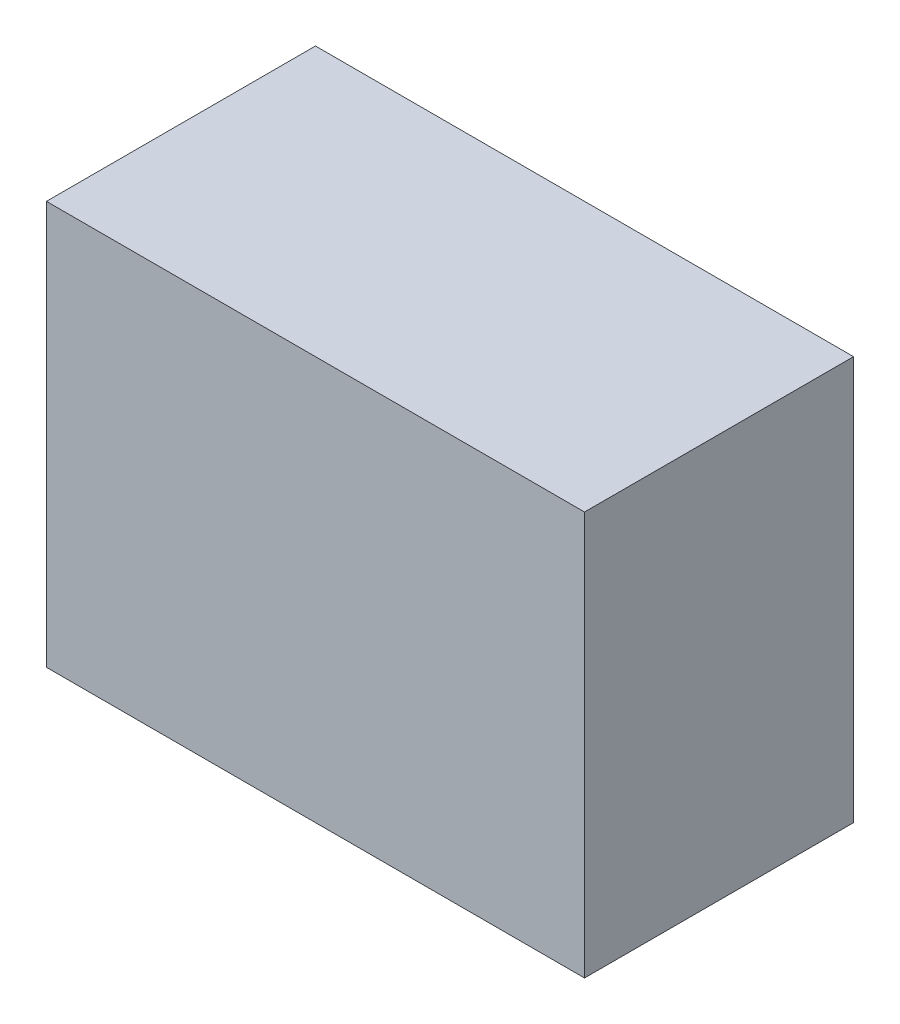
ISO-10303-21;
HEADER;
FILE_DESCRIPTION(('STEP AP214'),'2;1');
FILE_NAME('part.step','',(''),(''),'','','');
FILE_SCHEMA(('AUTOMOTIVE_DESIGN { 1 0 10303 214 1 1 1 1 }'));
ENDSEC;
DATA;
#1=APPLICATION_CONTEXT('core data for automotive mechanical design processes');
#2=APPLICATION_PROTOCOL_DEFINITION('international standard','automotive_design',2000,#1);
#3=PRODUCT_CONTEXT('',#1,'mechanical');
#4=PRODUCT('Part','Part','',(#3));
#5=PRODUCT_RELATED_PRODUCT_CATEGORY('part','',(#4));
#6=PRODUCT_DEFINITION_FORMATION('','',#4);
#7=PRODUCT_DEFINITION_CONTEXT('part definition',#1,'design');
#8=PRODUCT_DEFINITION('design','',#6,#7);
#9=PRODUCT_DEFINITION_SHAPE('','',#8);
#10=(LENGTH_UNIT() NAMED_UNIT(*) SI_UNIT(.MILLI.,.METRE.));
#11=(NAMED_UNIT(*) PLANE_ANGLE_UNIT() SI_UNIT($,.RADIAN.));
#12=(NAMED_UNIT(*) SI_UNIT($,.STERADIAN.) SOLID_ANGLE_UNIT());
#13=UNCERTAINTY_MEASURE_WITH_UNIT(LENGTH_MEASURE(1.E-05),#10,'distance_accuracy_value','');
#14=(GEOMETRIC_REPRESENTATION_CONTEXT(3) GLOBAL_UNCERTAINTY_ASSIGNED_CONTEXT((#13)) GLOBAL_UNIT_ASSIGNED_CONTEXT((#10,
#11,#12)) REPRESENTATION_CONTEXT('',''));
#15=CARTESIAN_POINT('',(0.,0.,0.));
#16=DIRECTION('',(0.,0.,1.));
#17=DIRECTION('',(1.,0.,0.));
#18=AXIS2_PLACEMENT_3D('',#15,#16,#17);
#19=CARTESIAN_POINT('',(0.,0.,20.));
#20=DIRECTION('',(1.,0.,0.));
#21=DIRECTION('',(0.,1.,0.));
#22=AXIS2_PLACEMENT_3D('',#19,#20,#21);
#23=PLANE('',#22);
#24=DIRECTION('',(0.,-1.,0.));
#25=VECTOR('',#24,1.);
#26=CARTESIAN_POINT('',(0.,0.,0.));
#27=LINE('',#26,#25);
#28=CARTESIAN_POINT('',(0.,30.,0.));
#29=VERTEX_POINT('',#28);
#30=CARTESIAN_POINT('',(0.,0.,0.));
#31=VERTEX_POINT('',#30);
#32=EDGE_CURVE('E96',#29,#31,#27,.T.);
#33=ORIENTED_EDGE('',*,*,#32,.T.);
#34=DIRECTION('',(0.,0.,-1.));
#35=VECTOR('',#34,1.);
#36=CARTESIAN_POINT('',(0.,0.,20.));
#37=LINE('',#36,#35);
#38=CARTESIAN_POINT('',(0.,0.,20.));
#39=VERTEX_POINT('',#38);
#40=EDGE_CURVE('E11',#39,#31,#37,.T.);
#41=ORIENTED_EDGE('',*,*,#40,.F.);
#42=DIRECTION('',(0.,-1.,0.));
#43=VECTOR('',#42,1.);
#44=CARTESIAN_POINT('',(0.,0.,20.));
#45=LINE('',#44,#43);
#46=CARTESIAN_POINT('',(0.,30.,20.));
#47=VERTEX_POINT('',#46);
#48=EDGE_CURVE('E84',#47,#39,#45,.T.);
#49=ORIENTED_EDGE('',*,*,#48,.F.);
#50=DIRECTION('',(0.,0.,-1.));
#51=VECTOR('',#50,1.);
#52=CARTESIAN_POINT('',(0.,30.,20.));
#53=LINE('',#52,#51);
#54=EDGE_CURVE('E92',#47,#29,#53,.T.);
#55=ORIENTED_EDGE('',*,*,#54,.T.);
#56=EDGE_LOOP('',(#33,#41,#49,#55));
#57=FACE_BOUND('',#56,.T.);
#58=ADVANCED_FACE('F33',(#57),#23,.F.);
#59=CARTESIAN_POINT('',(0.,0.,20.));
#60=DIRECTION('',(0.,1.,0.));
#61=DIRECTION('',(0.,0.,1.));
#62=AXIS2_PLACEMENT_3D('',#59,#60,#61);
#63=PLANE('',#62);
#64=DIRECTION('',(1.,0.,0.));
#65=VECTOR('',#64,1.);
#66=CARTESIAN_POINT('',(0.,0.,0.));
#67=LINE('',#66,#65);
#68=CARTESIAN_POINT('',(40.,0.,0.));
#69=VERTEX_POINT('',#68);
#70=EDGE_CURVE('E88',#31,#69,#67,.T.);
#71=ORIENTED_EDGE('',*,*,#70,.T.);
#72=DIRECTION('',(0.,0.,-1.));
#73=VECTOR('',#72,1.);
#74=CARTESIAN_POINT('',(40.,0.,20.));
#75=LINE('',#74,#73);
#76=CARTESIAN_POINT('',(40.,0.,20.));
#77=VERTEX_POINT('',#76);
#78=EDGE_CURVE('E41',#77,#69,#75,.T.);
#79=ORIENTED_EDGE('',*,*,#78,.F.);
#80=DIRECTION('',(1.,0.,0.));
#81=VECTOR('',#80,1.);
#82=CARTESIAN_POINT('',(0.,0.,20.));
#83=LINE('',#82,#81);
#84=EDGE_CURVE('E79',#39,#77,#83,.T.);
#85=ORIENTED_EDGE('',*,*,#84,.F.);
#86=ORIENTED_EDGE('',*,*,#40,.T.);
#87=EDGE_LOOP('',(#71,#79,#85,#86));
#88=FACE_BOUND('',#87,.T.);
#89=ADVANCED_FACE('F87',(#88),#63,.F.);
#90=CARTESIAN_POINT('',(40.,0.,20.));
#91=DIRECTION('',(-1.,0.,0.));
#92=DIRECTION('',(0.,-1.,0.));
#93=AXIS2_PLACEMENT_3D('',#90,#91,#92);
#94=PLANE('',#93);
#95=DIRECTION('',(0.,1.,0.));
#96=VECTOR('',#95,1.);
#97=CARTESIAN_POINT('',(40.,0.,0.));
#98=LINE('',#97,#96);
#99=CARTESIAN_POINT('',(40.,30.,0.));
#100=VERTEX_POINT('',#99);
#101=EDGE_CURVE('E66',#69,#100,#98,.T.);
#102=ORIENTED_EDGE('',*,*,#101,.T.);
#103=DIRECTION('',(0.,0.,-1.));
#104=VECTOR('',#103,1.);
#105=CARTESIAN_POINT('',(40.,30.,20.));
#106=LINE('',#105,#104);
#107=CARTESIAN_POINT('',(40.,30.,20.));
#108=VERTEX_POINT('',#107);
#109=EDGE_CURVE('E89',#108,#100,#106,.T.);
#110=ORIENTED_EDGE('',*,*,#109,.F.);
#111=DIRECTION('',(0.,1.,0.));
#112=VECTOR('',#111,1.);
#113=CARTESIAN_POINT('',(40.,0.,20.));
#114=LINE('',#113,#112);
#115=EDGE_CURVE('E82',#77,#108,#114,.T.);
#116=ORIENTED_EDGE('',*,*,#115,.F.);
#117=ORIENTED_EDGE('',*,*,#78,.T.);
#118=EDGE_LOOP('',(#102,#110,#116,#117));
#119=FACE_BOUND('',#118,.T.);
#120=ADVANCED_FACE('F90',(#119),#94,.F.);
#121=CARTESIAN_POINT('',(0.,30.,20.));
#122=DIRECTION('',(0.,-1.,0.));
#123=DIRECTION('',(0.,0.,-1.));
#124=AXIS2_PLACEMENT_3D('',#121,#122,#123);
#125=PLANE('',#124);
#126=DIRECTION('',(-1.,0.,0.));
#127=VECTOR('',#126,1.);
#128=CARTESIAN_POINT('',(0.,30.,0.));
#129=LINE('',#128,#127);
#130=EDGE_CURVE('E72',#100,#29,#129,.T.);
#131=ORIENTED_EDGE('',*,*,#130,.T.);
#132=ORIENTED_EDGE('',*,*,#54,.F.);
#133=DIRECTION('',(-1.,0.,0.));
#134=VECTOR('',#133,1.);
#135=CARTESIAN_POINT('',(0.,30.,20.));
#136=LINE('',#135,#134);
#137=EDGE_CURVE('E49',#108,#47,#136,.T.);
#138=ORIENTED_EDGE('',*,*,#137,.F.);
#139=ORIENTED_EDGE('',*,*,#109,.T.);
#140=EDGE_LOOP('',(#131,#132,#138,#139));
#141=FACE_BOUND('',#140,.T.);
#142=ADVANCED_FACE('F104',(#141),#125,.F.);
#143=CARTESIAN_POINT('',(0.,0.,20.));
#144=DIRECTION('',(0.,0.,-1.));
#145=DIRECTION('',(-1.,0.,0.));
#146=AXIS2_PLACEMENT_3D('',#143,#144,#145);
#147=PLANE('',#146);
#148=ORIENTED_EDGE('',*,*,#48,.T.);
#149=ORIENTED_EDGE('',*,*,#84,.T.);
#150=ORIENTED_EDGE('',*,*,#115,.T.);
#151=ORIENTED_EDGE('',*,*,#137,.T.);
#152=EDGE_LOOP('',(#148,#149,#150,#151));
#153=FACE_BOUND('',#152,.T.);
#154=ADVANCED_FACE('F80',(#153),#147,.F.);
#155=CARTESIAN_POINT('',(0.,0.,0.));
#156=DIRECTION('',(0.,0.,-1.));
#157=DIRECTION('',(-1.,0.,0.));
#158=AXIS2_PLACEMENT_3D('',#155,#156,#157);
#159=PLANE('',#158);
#160=CARTESIAN_POINT('',(20.,15.,0.));
#161=DIRECTION('',(0.,0.,-1.));
#162=DIRECTION('',(-1.,0.,0.));
#163=AXIS2_PLACEMENT_3D('',#160,#161,#162);
#164=CIRCLE('',#163,11.);
#165=CARTESIAN_POINT('',(9.00000000000001,15.,0.));
#166=VERTEX_POINT('',#165);
#167=EDGE_CURVE('E110',#166,#166,#164,.T.);
#168=ORIENTED_EDGE('',*,*,#167,.F.);
#169=EDGE_LOOP('',(#168));
#170=FACE_BOUND('',#169,.T.);
#171=ORIENTED_EDGE('',*,*,#32,.F.);
#172=ORIENTED_EDGE('',*,*,#130,.F.);
#173=ORIENTED_EDGE('',*,*,#101,.F.);
#174=ORIENTED_EDGE('',*,*,#70,.F.);
#175=EDGE_LOOP('',(#171,#172,#173,#174));
#176=FACE_BOUND('',#175,.T.);
#177=ADVANCED_FACE('F107',(#170,#176),#159,.T.);
#178=CARTESIAN_POINT('',(20.,15.,7.));
#179=DIRECTION('',(0.,0.,-1.));
#180=DIRECTION('',(-1.,0.,0.));
#181=AXIS2_PLACEMENT_3D('',#178,#179,#180);
#182=CYLINDRICAL_SURFACE('',#181,11.);
#183=CARTESIAN_POINT('',(20.,15.,7.));
#184=DIRECTION('',(0.,0.,-1.));
#185=DIRECTION('',(-1.,0.,0.));
#186=AXIS2_PLACEMENT_3D('',#183,#184,#185);
#187=CIRCLE('',#186,11.);
#188=CARTESIAN_POINT('',(9.00000000000001,15.,7.));
#189=VERTEX_POINT('',#188);
#190=EDGE_CURVE('E99',#189,#189,#187,.T.);
#191=ORIENTED_EDGE('',*,*,#190,.F.);
#192=EDGE_LOOP('',(#191));
#193=FACE_BOUND('',#192,.T.);
#194=ORIENTED_EDGE('',*,*,#167,.T.);
#195=EDGE_LOOP('',(#194));
#196=FACE_BOUND('',#195,.T.);
#197=ADVANCED_FACE('F118',(#193,#196),#182,.F.);
#198=CARTESIAN_POINT('',(20.,15.,7.));
#199=DIRECTION('',(0.,0.,-1.));
#200=DIRECTION('',(-1.,0.,0.));
#201=AXIS2_PLACEMENT_3D('',#198,#199,#200);
#202=PLANE('',#201);
#203=ORIENTED_EDGE('',*,*,#190,.T.);
#204=EDGE_LOOP('',(#203));
#205=FACE_BOUND('',#204,.T.);
#206=ADVANCED_FACE('F116',(#205),#202,.T.);
#207=CLOSED_SHELL('',(#58,#89,#120,#142,#154,#177,#197,#206));
#208=MANIFOLD_SOLID_BREP('B2',#207);
#209=ADVANCED_BREP_SHAPE_REPRESENTATION('',(#18,#208),#14);
#210=SHAPE_DEFINITION_REPRESENTATION(#9,#209);
ENDSEC;
END-ISO-10303-21;
